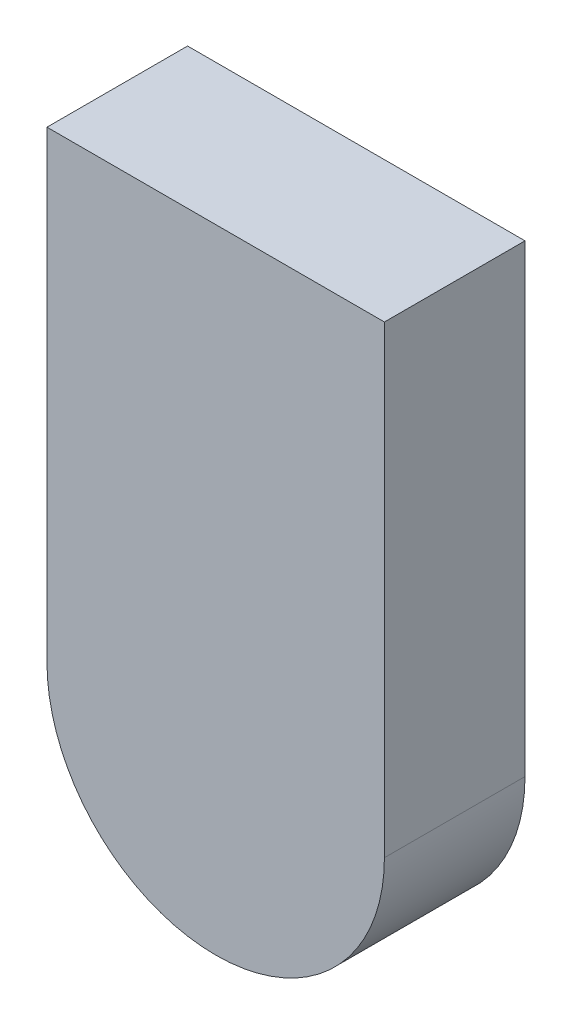
ISO-10303-21;
HEADER;
FILE_DESCRIPTION(('STEP AP214'),'2;1');
FILE_NAME('part.step','',(''),(''),'','','');
FILE_SCHEMA(('AUTOMOTIVE_DESIGN { 1 0 10303 214 1 1 1 1 }'));
ENDSEC;
DATA;
#1=APPLICATION_CONTEXT('core data for automotive mechanical design processes');
#2=APPLICATION_PROTOCOL_DEFINITION('international standard','automotive_design',2000,#1);
#3=PRODUCT_CONTEXT('',#1,'mechanical');
#4=PRODUCT('Part','Part','',(#3));
#5=PRODUCT_RELATED_PRODUCT_CATEGORY('part','',(#4));
#6=PRODUCT_DEFINITION_FORMATION('','',#4);
#7=PRODUCT_DEFINITION_CONTEXT('part definition',#1,'design');
#8=PRODUCT_DEFINITION('design','',#6,#7);
#9=PRODUCT_DEFINITION_SHAPE('','',#8);
#10=(LENGTH_UNIT() NAMED_UNIT(*) SI_UNIT(.MILLI.,.METRE.));
#11=(NAMED_UNIT(*) PLANE_ANGLE_UNIT() SI_UNIT($,.RADIAN.));
#12=(NAMED_UNIT(*) SI_UNIT($,.STERADIAN.) SOLID_ANGLE_UNIT());
#13=UNCERTAINTY_MEASURE_WITH_UNIT(LENGTH_MEASURE(1.E-05),#10,'distance_accuracy_value','');
#14=(GEOMETRIC_REPRESENTATION_CONTEXT(3) GLOBAL_UNCERTAINTY_ASSIGNED_CONTEXT((#13)) GLOBAL_UNIT_ASSIGNED_CONTEXT((#10,
#11,#12)) REPRESENTATION_CONTEXT('',''));
#15=CARTESIAN_POINT('',(0.,0.,0.));
#16=DIRECTION('',(0.,0.,1.));
#17=DIRECTION('',(1.,0.,0.));
#18=AXIS2_PLACEMENT_3D('',#15,#16,#17);
#19=CARTESIAN_POINT('',(1.63,4.05,0.));
#20=DIRECTION('',(0.,1.,0.));
#21=DIRECTION('',(1.,0.,0.));
#22=AXIS2_PLACEMENT_3D('',#19,#20,#21);
#23=PLANE('',#22);
#24=DIRECTION('',(0.,0.,1.));
#25=VECTOR('',#24,1.);
#26=CARTESIAN_POINT('',(1.63,4.05,0.));
#27=LINE('',#26,#25);
#28=CARTESIAN_POINT('',(1.63,4.05,0.));
#29=VERTEX_POINT('',#28);
#30=CARTESIAN_POINT('',(1.63,4.05,0.1));
#31=VERTEX_POINT('',#30);
#32=EDGE_CURVE('E11',#29,#31,#27,.T.);
#33=ORIENTED_EDGE('',*,*,#32,.T.);
#34=DIRECTION('',(1.,0.,0.));
#35=VECTOR('',#34,1.);
#36=CARTESIAN_POINT('',(1.63,4.05,0.1));
#37=LINE('',#36,#35);
#38=CARTESIAN_POINT('',(1.87,4.05,0.1));
#39=VERTEX_POINT('',#38);
#40=EDGE_CURVE('E24',#31,#39,#37,.T.);
#41=ORIENTED_EDGE('',*,*,#40,.T.);
#42=DIRECTION('',(0.,0.,1.));
#43=VECTOR('',#42,1.);
#44=CARTESIAN_POINT('',(1.87,4.05,0.));
#45=LINE('',#44,#43);
#46=CARTESIAN_POINT('',(1.87,4.05,0.));
#47=VERTEX_POINT('',#46);
#48=EDGE_CURVE('E85',#47,#39,#45,.T.);
#49=ORIENTED_EDGE('',*,*,#48,.F.);
#50=DIRECTION('',(1.,0.,0.));
#51=VECTOR('',#50,1.);
#52=CARTESIAN_POINT('',(1.63,4.05,0.));
#53=LINE('',#52,#51);
#54=EDGE_CURVE('E82',#29,#47,#53,.T.);
#55=ORIENTED_EDGE('',*,*,#54,.F.);
#56=EDGE_LOOP('',(#33,#41,#49,#55));
#57=FACE_BOUND('',#56,.T.);
#58=ADVANCED_FACE('F17',(#57),#23,.T.);
#59=CARTESIAN_POINT('',(1.87,4.05,0.));
#60=DIRECTION('',(1.,0.,0.));
#61=DIRECTION('',(0.,-1.,0.));
#62=AXIS2_PLACEMENT_3D('',#59,#60,#61);
#63=PLANE('',#62);
#64=ORIENTED_EDGE('',*,*,#48,.T.);
#65=DIRECTION('',(0.,-1.,0.));
#66=VECTOR('',#65,1.);
#67=CARTESIAN_POINT('',(1.87,4.05,0.1));
#68=LINE('',#67,#66);
#69=CARTESIAN_POINT('',(1.87,3.72,0.1));
#70=VERTEX_POINT('',#69);
#71=EDGE_CURVE('E80',#39,#70,#68,.T.);
#72=ORIENTED_EDGE('',*,*,#71,.T.);
#73=DIRECTION('',(0.,0.,1.));
#74=VECTOR('',#73,1.);
#75=CARTESIAN_POINT('',(1.87,3.72,0.));
#76=LINE('',#75,#74);
#77=CARTESIAN_POINT('',(1.87,3.72,0.));
#78=VERTEX_POINT('',#77);
#79=EDGE_CURVE('E60',#78,#70,#76,.T.);
#80=ORIENTED_EDGE('',*,*,#79,.F.);
#81=DIRECTION('',(0.,-1.,0.));
#82=VECTOR('',#81,1.);
#83=CARTESIAN_POINT('',(1.87,4.05,0.));
#84=LINE('',#83,#82);
#85=EDGE_CURVE('E76',#47,#78,#84,.T.);
#86=ORIENTED_EDGE('',*,*,#85,.F.);
#87=EDGE_LOOP('',(#64,#72,#80,#86));
#88=FACE_BOUND('',#87,.T.);
#89=ADVANCED_FACE('F89',(#88),#63,.T.);
#90=CARTESIAN_POINT('',(1.75,3.72,0.));
#91=DIRECTION('',(0.,0.,-1.));
#92=DIRECTION('',(1.,0.,0.));
#93=AXIS2_PLACEMENT_3D('',#90,#91,#92);
#94=CYLINDRICAL_SURFACE('',#93,0.12);
#95=CARTESIAN_POINT('',(1.75,3.72,0.));
#96=DIRECTION('',(0.,0.,1.));
#97=DIRECTION('',(1.,0.,0.));
#98=AXIS2_PLACEMENT_3D('',#95,#96,#97);
#99=CIRCLE('',#98,0.12);
#100=CARTESIAN_POINT('',(1.63,3.72,0.));
#101=VERTEX_POINT('',#100);
#102=EDGE_CURVE('E64',#101,#78,#99,.T.);
#103=ORIENTED_EDGE('',*,*,#102,.T.);
#104=ORIENTED_EDGE('',*,*,#79,.T.);
#105=CARTESIAN_POINT('',(1.75,3.72,0.1));
#106=DIRECTION('',(0.,0.,1.));
#107=DIRECTION('',(1.,0.,0.));
#108=AXIS2_PLACEMENT_3D('',#105,#106,#107);
#109=CIRCLE('',#108,0.12);
#110=CARTESIAN_POINT('',(1.63,3.72,0.1));
#111=VERTEX_POINT('',#110);
#112=EDGE_CURVE('E55',#111,#70,#109,.T.);
#113=ORIENTED_EDGE('',*,*,#112,.F.);
#114=DIRECTION('',(0.,0.,1.));
#115=VECTOR('',#114,1.);
#116=CARTESIAN_POINT('',(1.63,3.72,0.));
#117=LINE('',#116,#115);
#118=EDGE_CURVE('E59',#101,#111,#117,.T.);
#119=ORIENTED_EDGE('',*,*,#118,.F.);
#120=EDGE_LOOP('',(#103,#104,#113,#119));
#121=FACE_BOUND('',#120,.T.);
#122=ADVANCED_FACE('F58',(#121),#94,.T.);
#123=CARTESIAN_POINT('',(1.63,4.05,0.));
#124=DIRECTION('',(1.,0.,0.));
#125=DIRECTION('',(0.,-1.,0.));
#126=AXIS2_PLACEMENT_3D('',#123,#124,#125);
#127=PLANE('',#126);
#128=DIRECTION('',(0.,-1.,0.));
#129=VECTOR('',#128,1.);
#130=CARTESIAN_POINT('',(1.63,4.05,0.));
#131=LINE('',#130,#129);
#132=EDGE_CURVE('E69',#29,#101,#131,.T.);
#133=ORIENTED_EDGE('',*,*,#132,.T.);
#134=ORIENTED_EDGE('',*,*,#118,.T.);
#135=DIRECTION('',(0.,-1.,0.));
#136=VECTOR('',#135,1.);
#137=CARTESIAN_POINT('',(1.63,4.05,0.1));
#138=LINE('',#137,#136);
#139=EDGE_CURVE('E67',#31,#111,#138,.T.);
#140=ORIENTED_EDGE('',*,*,#139,.F.);
#141=ORIENTED_EDGE('',*,*,#32,.F.);
#142=EDGE_LOOP('',(#133,#134,#140,#141));
#143=FACE_BOUND('',#142,.T.);
#144=ADVANCED_FACE('F66',(#143),#127,.F.);
#145=CARTESIAN_POINT('',(1.75,3.849490847913,0.));
#146=DIRECTION('',(0.,0.,-1.));
#147=DIRECTION('',(-1.,0.,0.));
#148=AXIS2_PLACEMENT_3D('',#145,#146,#147);
#149=PLANE('',#148);
#150=ORIENTED_EDGE('',*,*,#54,.T.);
#151=ORIENTED_EDGE('',*,*,#85,.T.);
#152=ORIENTED_EDGE('',*,*,#102,.F.);
#153=ORIENTED_EDGE('',*,*,#132,.F.);
#154=EDGE_LOOP('',(#150,#151,#152,#153));
#155=FACE_BOUND('',#154,.T.);
#156=ADVANCED_FACE('F91',(#155),#149,.T.);
#157=CARTESIAN_POINT('',(1.75,3.849490847913,0.1));
#158=DIRECTION('',(0.,0.,-1.));
#159=DIRECTION('',(-1.,0.,0.));
#160=AXIS2_PLACEMENT_3D('',#157,#158,#159);
#161=PLANE('',#160);
#162=ORIENTED_EDGE('',*,*,#139,.T.);
#163=ORIENTED_EDGE('',*,*,#112,.T.);
#164=ORIENTED_EDGE('',*,*,#71,.F.);
#165=ORIENTED_EDGE('',*,*,#40,.F.);
#166=EDGE_LOOP('',(#162,#163,#164,#165));
#167=FACE_BOUND('',#166,.T.);
#168=ADVANCED_FACE('F71',(#167),#161,.F.);
#169=CLOSED_SHELL('',(#58,#89,#122,#144,#156,#168));
#170=MANIFOLD_SOLID_BREP('B1',#169);
#171=ADVANCED_BREP_SHAPE_REPRESENTATION('',(#18,#170),#14);
#172=SHAPE_DEFINITION_REPRESENTATION(#9,#171);
ENDSEC;
END-ISO-10303-21;
